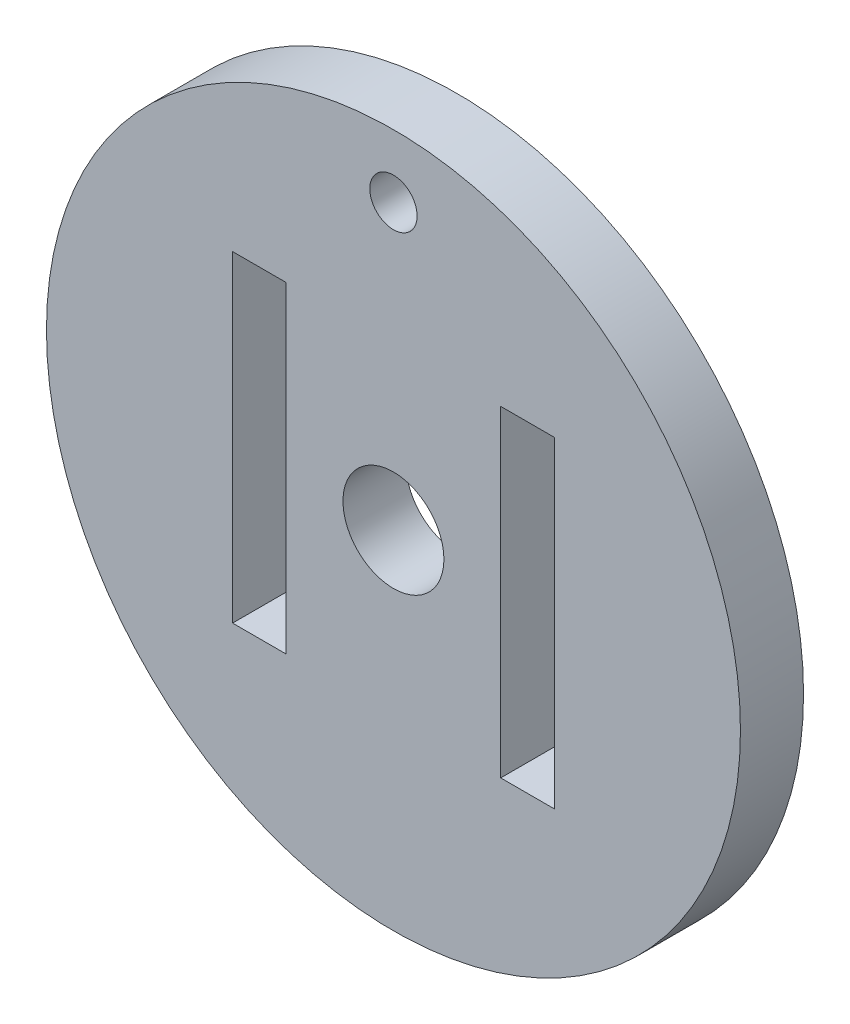
ISO-10303-21;
HEADER;
FILE_DESCRIPTION(('STEP AP214'),'2;1');
FILE_NAME('part.step','',(''),(''),'','','');
FILE_SCHEMA(('AUTOMOTIVE_DESIGN { 1 0 10303 214 1 1 1 1 }'));
ENDSEC;
DATA;
#1=APPLICATION_CONTEXT('core data for automotive mechanical design processes');
#2=APPLICATION_PROTOCOL_DEFINITION('international standard','automotive_design',2000,#1);
#3=PRODUCT_CONTEXT('',#1,'mechanical');
#4=PRODUCT('Part','Part','',(#3));
#5=PRODUCT_RELATED_PRODUCT_CATEGORY('part','',(#4));
#6=PRODUCT_DEFINITION_FORMATION('','',#4);
#7=PRODUCT_DEFINITION_CONTEXT('part definition',#1,'design');
#8=PRODUCT_DEFINITION('design','',#6,#7);
#9=PRODUCT_DEFINITION_SHAPE('','',#8);
#10=(LENGTH_UNIT() NAMED_UNIT(*) SI_UNIT(.MILLI.,.METRE.));
#11=(NAMED_UNIT(*) PLANE_ANGLE_UNIT() SI_UNIT($,.RADIAN.));
#12=(NAMED_UNIT(*) SI_UNIT($,.STERADIAN.) SOLID_ANGLE_UNIT());
#13=UNCERTAINTY_MEASURE_WITH_UNIT(LENGTH_MEASURE(1.E-05),#10,'distance_accuracy_value','');
#14=(GEOMETRIC_REPRESENTATION_CONTEXT(3) GLOBAL_UNCERTAINTY_ASSIGNED_CONTEXT((#13)) GLOBAL_UNIT_ASSIGNED_CONTEXT((#10,
#11,#12)) REPRESENTATION_CONTEXT('',''));
#15=CARTESIAN_POINT('',(0.,0.,0.));
#16=DIRECTION('',(0.,0.,1.));
#17=DIRECTION('',(1.,0.,0.));
#18=AXIS2_PLACEMENT_3D('',#15,#16,#17);
#19=CARTESIAN_POINT('',(0.,0.,2.));
#20=DIRECTION('',(0.,0.,1.));
#21=DIRECTION('',(1.,0.,0.));
#22=AXIS2_PLACEMENT_3D('',#19,#20,#21);
#23=PLANE('',#22);
#24=DIRECTION('',(1.,0.,0.));
#25=VECTOR('',#24,1.);
#26=CARTESIAN_POINT('',(-5.1,-5.1,2.));
#27=LINE('',#26,#25);
#28=CARTESIAN_POINT('',(-5.1,-5.1,2.));
#29=VERTEX_POINT('',#28);
#30=CARTESIAN_POINT('',(-3.4,-5.1,2.));
#31=VERTEX_POINT('',#30);
#32=EDGE_CURVE('E135',#29,#31,#27,.T.);
#33=ORIENTED_EDGE('',*,*,#32,.F.);
#34=DIRECTION('',(0.,-1.,0.));
#35=VECTOR('',#34,1.);
#36=CARTESIAN_POINT('',(-5.1,5.1,2.));
#37=LINE('',#36,#35);
#38=CARTESIAN_POINT('',(-5.1,5.1,2.));
#39=VERTEX_POINT('',#38);
#40=EDGE_CURVE('E133',#39,#29,#37,.T.);
#41=ORIENTED_EDGE('',*,*,#40,.F.);
#42=DIRECTION('',(-1.,0.,0.));
#43=VECTOR('',#42,1.);
#44=CARTESIAN_POINT('',(-5.1,5.1,2.));
#45=LINE('',#44,#43);
#46=CARTESIAN_POINT('',(-3.4,5.1,2.));
#47=VERTEX_POINT('',#46);
#48=EDGE_CURVE('E141',#47,#39,#45,.T.);
#49=ORIENTED_EDGE('',*,*,#48,.F.);
#50=DIRECTION('',(0.,1.,0.));
#51=VECTOR('',#50,1.);
#52=CARTESIAN_POINT('',(-3.4,5.1,2.));
#53=LINE('',#52,#51);
#54=EDGE_CURVE('E138',#31,#47,#53,.T.);
#55=ORIENTED_EDGE('',*,*,#54,.F.);
#56=EDGE_LOOP('',(#33,#41,#49,#55));
#57=FACE_BOUND('',#56,.T.);
#58=CARTESIAN_POINT('',(0.,0.,2.));
#59=DIRECTION('',(0.,0.,1.));
#60=DIRECTION('',(1.,0.,0.));
#61=AXIS2_PLACEMENT_3D('',#58,#59,#60);
#62=CIRCLE('',#61,1.6);
#63=CARTESIAN_POINT('',(1.6,0.,2.));
#64=VERTEX_POINT('',#63);
#65=EDGE_CURVE('E170',#64,#64,#62,.T.);
#66=ORIENTED_EDGE('',*,*,#65,.F.);
#67=EDGE_LOOP('',(#66));
#68=FACE_BOUND('',#67,.T.);
#69=CARTESIAN_POINT('',(0.,0.,2.));
#70=DIRECTION('',(0.,0.,1.));
#71=DIRECTION('',(1.,0.,0.));
#72=AXIS2_PLACEMENT_3D('',#69,#70,#71);
#73=CIRCLE('',#72,10.9999999999456);
#74=CARTESIAN_POINT('',(10.9999999999456,0.,2.));
#75=VERTEX_POINT('',#74);
#76=EDGE_CURVE('E11',#75,#75,#73,.T.);
#77=ORIENTED_EDGE('',*,*,#76,.T.);
#78=EDGE_LOOP('',(#77));
#79=FACE_BOUND('',#78,.T.);
#80=CARTESIAN_POINT('',(0.,9.,2.));
#81=DIRECTION('',(0.,0.,1.));
#82=DIRECTION('',(1.,0.,0.));
#83=AXIS2_PLACEMENT_3D('',#80,#81,#82);
#84=CIRCLE('',#83,0.75);
#85=CARTESIAN_POINT('',(0.75,9.,2.));
#86=VERTEX_POINT('',#85);
#87=EDGE_CURVE('E164',#86,#86,#84,.T.);
#88=ORIENTED_EDGE('',*,*,#87,.F.);
#89=EDGE_LOOP('',(#88));
#90=FACE_BOUND('',#89,.T.);
#91=DIRECTION('',(0.,-1.,0.));
#92=VECTOR('',#91,1.);
#93=CARTESIAN_POINT('',(3.4,5.1,2.));
#94=LINE('',#93,#92);
#95=CARTESIAN_POINT('',(3.4,5.1,2.));
#96=VERTEX_POINT('',#95);
#97=CARTESIAN_POINT('',(3.4,-5.1,2.));
#98=VERTEX_POINT('',#97);
#99=EDGE_CURVE('E105',#96,#98,#94,.T.);
#100=ORIENTED_EDGE('',*,*,#99,.F.);
#101=DIRECTION('',(-1.,0.,0.));
#102=VECTOR('',#101,1.);
#103=CARTESIAN_POINT('',(5.1,5.1,2.));
#104=LINE('',#103,#102);
#105=CARTESIAN_POINT('',(5.1,5.1,2.));
#106=VERTEX_POINT('',#105);
#107=EDGE_CURVE('E97',#106,#96,#104,.T.);
#108=ORIENTED_EDGE('',*,*,#107,.F.);
#109=DIRECTION('',(0.,1.,0.));
#110=VECTOR('',#109,1.);
#111=CARTESIAN_POINT('',(5.1,5.1,2.));
#112=LINE('',#111,#110);
#113=CARTESIAN_POINT('',(5.1,-5.1,2.));
#114=VERTEX_POINT('',#113);
#115=EDGE_CURVE('E119',#114,#106,#112,.T.);
#116=ORIENTED_EDGE('',*,*,#115,.F.);
#117=DIRECTION('',(1.,0.,0.));
#118=VECTOR('',#117,1.);
#119=CARTESIAN_POINT('',(5.1,-5.1,2.));
#120=LINE('',#119,#118);
#121=EDGE_CURVE('E117',#98,#114,#120,.T.);
#122=ORIENTED_EDGE('',*,*,#121,.F.);
#123=EDGE_LOOP('',(#100,#108,#116,#122));
#124=FACE_BOUND('',#123,.T.);
#125=ADVANCED_FACE('F32',(#57,#68,#79,#90,#124),#23,.T.);
#126=CARTESIAN_POINT('',(0.,0.,0.));
#127=DIRECTION('',(0.,0.,1.));
#128=DIRECTION('',(1.,0.,0.));
#129=AXIS2_PLACEMENT_3D('',#126,#127,#128);
#130=PLANE('',#129);
#131=DIRECTION('',(0.,-1.,0.));
#132=VECTOR('',#131,1.);
#133=CARTESIAN_POINT('',(-5.1,5.1,0.));
#134=LINE('',#133,#132);
#135=CARTESIAN_POINT('',(-5.1,5.1,0.));
#136=VERTEX_POINT('',#135);
#137=CARTESIAN_POINT('',(-5.1,-5.1,0.));
#138=VERTEX_POINT('',#137);
#139=EDGE_CURVE('E113',#136,#138,#134,.T.);
#140=ORIENTED_EDGE('',*,*,#139,.T.);
#141=DIRECTION('',(1.,0.,0.));
#142=VECTOR('',#141,1.);
#143=CARTESIAN_POINT('',(-5.1,-5.1,0.));
#144=LINE('',#143,#142);
#145=CARTESIAN_POINT('',(-3.4,-5.1,0.));
#146=VERTEX_POINT('',#145);
#147=EDGE_CURVE('E146',#138,#146,#144,.T.);
#148=ORIENTED_EDGE('',*,*,#147,.T.);
#149=DIRECTION('',(0.,1.,0.));
#150=VECTOR('',#149,1.);
#151=CARTESIAN_POINT('',(-3.4,5.1,0.));
#152=LINE('',#151,#150);
#153=CARTESIAN_POINT('',(-3.4,5.1,0.));
#154=VERTEX_POINT('',#153);
#155=EDGE_CURVE('E149',#146,#154,#152,.T.);
#156=ORIENTED_EDGE('',*,*,#155,.T.);
#157=DIRECTION('',(-1.,0.,0.));
#158=VECTOR('',#157,1.);
#159=CARTESIAN_POINT('',(-5.1,5.1,0.));
#160=LINE('',#159,#158);
#161=EDGE_CURVE('E136',#154,#136,#160,.T.);
#162=ORIENTED_EDGE('',*,*,#161,.T.);
#163=EDGE_LOOP('',(#140,#148,#156,#162));
#164=FACE_BOUND('',#163,.T.);
#165=CARTESIAN_POINT('',(0.,0.,0.));
#166=DIRECTION('',(0.,0.,1.));
#167=DIRECTION('',(1.,0.,0.));
#168=AXIS2_PLACEMENT_3D('',#165,#166,#167);
#169=CIRCLE('',#168,1.6);
#170=CARTESIAN_POINT('',(1.6,0.,0.));
#171=VERTEX_POINT('',#170);
#172=EDGE_CURVE('E167',#171,#171,#169,.T.);
#173=ORIENTED_EDGE('',*,*,#172,.T.);
#174=EDGE_LOOP('',(#173));
#175=FACE_BOUND('',#174,.T.);
#176=CARTESIAN_POINT('',(0.,0.,0.));
#177=DIRECTION('',(0.,0.,1.));
#178=DIRECTION('',(1.,0.,0.));
#179=AXIS2_PLACEMENT_3D('',#176,#177,#178);
#180=CIRCLE('',#179,10.9999999999456);
#181=CARTESIAN_POINT('',(10.9999999999456,0.,0.));
#182=VERTEX_POINT('',#181);
#183=EDGE_CURVE('E36',#182,#182,#180,.T.);
#184=ORIENTED_EDGE('',*,*,#183,.F.);
#185=EDGE_LOOP('',(#184));
#186=FACE_BOUND('',#185,.T.);
#187=CARTESIAN_POINT('',(0.,9.,0.));
#188=DIRECTION('',(0.,0.,1.));
#189=DIRECTION('',(1.,0.,0.));
#190=AXIS2_PLACEMENT_3D('',#187,#188,#189);
#191=CIRCLE('',#190,0.75);
#192=CARTESIAN_POINT('',(0.75,9.,0.));
#193=VERTEX_POINT('',#192);
#194=EDGE_CURVE('E163',#193,#193,#191,.T.);
#195=ORIENTED_EDGE('',*,*,#194,.T.);
#196=EDGE_LOOP('',(#195));
#197=FACE_BOUND('',#196,.T.);
#198=DIRECTION('',(-1.,0.,0.));
#199=VECTOR('',#198,1.);
#200=CARTESIAN_POINT('',(5.1,5.1,0.));
#201=LINE('',#200,#199);
#202=CARTESIAN_POINT('',(5.1,5.1,0.));
#203=VERTEX_POINT('',#202);
#204=CARTESIAN_POINT('',(3.4,5.1,0.));
#205=VERTEX_POINT('',#204);
#206=EDGE_CURVE('E55',#203,#205,#201,.T.);
#207=ORIENTED_EDGE('',*,*,#206,.T.);
#208=DIRECTION('',(0.,-1.,0.));
#209=VECTOR('',#208,1.);
#210=CARTESIAN_POINT('',(3.4,5.1,0.));
#211=LINE('',#210,#209);
#212=CARTESIAN_POINT('',(3.4,-5.1,0.));
#213=VERTEX_POINT('',#212);
#214=EDGE_CURVE('E112',#205,#213,#211,.T.);
#215=ORIENTED_EDGE('',*,*,#214,.T.);
#216=DIRECTION('',(1.,0.,0.));
#217=VECTOR('',#216,1.);
#218=CARTESIAN_POINT('',(5.1,-5.1,0.));
#219=LINE('',#218,#217);
#220=CARTESIAN_POINT('',(5.1,-5.1,0.));
#221=VERTEX_POINT('',#220);
#222=EDGE_CURVE('E125',#213,#221,#219,.T.);
#223=ORIENTED_EDGE('',*,*,#222,.T.);
#224=DIRECTION('',(0.,1.,0.));
#225=VECTOR('',#224,1.);
#226=CARTESIAN_POINT('',(5.1,5.1,0.));
#227=LINE('',#226,#225);
#228=EDGE_CURVE('E106',#221,#203,#227,.T.);
#229=ORIENTED_EDGE('',*,*,#228,.T.);
#230=EDGE_LOOP('',(#207,#215,#223,#229));
#231=FACE_BOUND('',#230,.T.);
#232=ADVANCED_FACE('F176',(#164,#175,#186,#197,#231),#130,.F.);
#233=CARTESIAN_POINT('',(0.,0.,2.));
#234=DIRECTION('',(0.,0.,-1.));
#235=DIRECTION('',(-1.,0.,0.));
#236=AXIS2_PLACEMENT_3D('',#233,#234,#235);
#237=CYLINDRICAL_SURFACE('',#236,10.9999999999456);
#238=ORIENTED_EDGE('',*,*,#76,.F.);
#239=EDGE_LOOP('',(#238));
#240=FACE_BOUND('',#239,.T.);
#241=ORIENTED_EDGE('',*,*,#183,.T.);
#242=EDGE_LOOP('',(#241));
#243=FACE_BOUND('',#242,.T.);
#244=ADVANCED_FACE('F34',(#240,#243),#237,.T.);
#245=CARTESIAN_POINT('',(0.,0.,2.));
#246=DIRECTION('',(0.,0.,-1.));
#247=DIRECTION('',(-1.,0.,0.));
#248=AXIS2_PLACEMENT_3D('',#245,#246,#247);
#249=CYLINDRICAL_SURFACE('',#248,1.6);
#250=ORIENTED_EDGE('',*,*,#65,.T.);
#251=EDGE_LOOP('',(#250));
#252=FACE_BOUND('',#251,.T.);
#253=ORIENTED_EDGE('',*,*,#172,.F.);
#254=EDGE_LOOP('',(#253));
#255=FACE_BOUND('',#254,.T.);
#256=ADVANCED_FACE('F179',(#252,#255),#249,.F.);
#257=CARTESIAN_POINT('',(0.,9.,2.));
#258=DIRECTION('',(0.,0.,-1.));
#259=DIRECTION('',(-1.,0.,0.));
#260=AXIS2_PLACEMENT_3D('',#257,#258,#259);
#261=CYLINDRICAL_SURFACE('',#260,0.75);
#262=ORIENTED_EDGE('',*,*,#87,.T.);
#263=EDGE_LOOP('',(#262));
#264=FACE_BOUND('',#263,.T.);
#265=ORIENTED_EDGE('',*,*,#194,.F.);
#266=EDGE_LOOP('',(#265));
#267=FACE_BOUND('',#266,.T.);
#268=ADVANCED_FACE('F181',(#264,#267),#261,.F.);
#269=CARTESIAN_POINT('',(-5.1,5.1,2.));
#270=DIRECTION('',(1.,0.,0.));
#271=DIRECTION('',(0.,0.,-1.));
#272=AXIS2_PLACEMENT_3D('',#269,#270,#271);
#273=PLANE('',#272);
#274=ORIENTED_EDGE('',*,*,#139,.F.);
#275=DIRECTION('',(0.,0.,-1.));
#276=VECTOR('',#275,1.);
#277=CARTESIAN_POINT('',(-5.1,5.1,2.));
#278=LINE('',#277,#276);
#279=EDGE_CURVE('E143',#39,#136,#278,.T.);
#280=ORIENTED_EDGE('',*,*,#279,.F.);
#281=ORIENTED_EDGE('',*,*,#40,.T.);
#282=DIRECTION('',(0.,0.,-1.));
#283=VECTOR('',#282,1.);
#284=CARTESIAN_POINT('',(-5.1,-5.1,2.));
#285=LINE('',#284,#283);
#286=EDGE_CURVE('E160',#29,#138,#285,.T.);
#287=ORIENTED_EDGE('',*,*,#286,.T.);
#288=EDGE_LOOP('',(#274,#280,#281,#287));
#289=FACE_BOUND('',#288,.T.);
#290=ADVANCED_FACE('F188',(#289),#273,.T.);
#291=CARTESIAN_POINT('',(-5.1,-5.1,2.));
#292=DIRECTION('',(0.,1.,0.));
#293=DIRECTION('',(0.,0.,1.));
#294=AXIS2_PLACEMENT_3D('',#291,#292,#293);
#295=PLANE('',#294);
#296=ORIENTED_EDGE('',*,*,#147,.F.);
#297=ORIENTED_EDGE('',*,*,#286,.F.);
#298=ORIENTED_EDGE('',*,*,#32,.T.);
#299=DIRECTION('',(0.,0.,-1.));
#300=VECTOR('',#299,1.);
#301=CARTESIAN_POINT('',(-3.4,-5.1,2.));
#302=LINE('',#301,#300);
#303=EDGE_CURVE('E158',#31,#146,#302,.T.);
#304=ORIENTED_EDGE('',*,*,#303,.T.);
#305=EDGE_LOOP('',(#296,#297,#298,#304));
#306=FACE_BOUND('',#305,.T.);
#307=ADVANCED_FACE('F234',(#306),#295,.T.);
#308=CARTESIAN_POINT('',(-3.4,5.1,2.));
#309=DIRECTION('',(-1.,0.,0.));
#310=DIRECTION('',(0.,0.,1.));
#311=AXIS2_PLACEMENT_3D('',#308,#309,#310);
#312=PLANE('',#311);
#313=ORIENTED_EDGE('',*,*,#155,.F.);
#314=ORIENTED_EDGE('',*,*,#303,.F.);
#315=ORIENTED_EDGE('',*,*,#54,.T.);
#316=DIRECTION('',(0.,0.,-1.));
#317=VECTOR('',#316,1.);
#318=CARTESIAN_POINT('',(-3.4,5.1,2.));
#319=LINE('',#318,#317);
#320=EDGE_CURVE('E156',#47,#154,#319,.T.);
#321=ORIENTED_EDGE('',*,*,#320,.T.);
#322=EDGE_LOOP('',(#313,#314,#315,#321));
#323=FACE_BOUND('',#322,.T.);
#324=ADVANCED_FACE('F230',(#323),#312,.T.);
#325=CARTESIAN_POINT('',(-5.1,5.1,2.));
#326=DIRECTION('',(0.,-1.,0.));
#327=DIRECTION('',(0.,0.,-1.));
#328=AXIS2_PLACEMENT_3D('',#325,#326,#327);
#329=PLANE('',#328);
#330=ORIENTED_EDGE('',*,*,#161,.F.);
#331=ORIENTED_EDGE('',*,*,#320,.F.);
#332=ORIENTED_EDGE('',*,*,#48,.T.);
#333=ORIENTED_EDGE('',*,*,#279,.T.);
#334=EDGE_LOOP('',(#330,#331,#332,#333));
#335=FACE_BOUND('',#334,.T.);
#336=ADVANCED_FACE('F227',(#335),#329,.T.);
#337=CARTESIAN_POINT('',(5.1,5.1,2.));
#338=DIRECTION('',(0.,-1.,0.));
#339=DIRECTION('',(0.,0.,-1.));
#340=AXIS2_PLACEMENT_3D('',#337,#338,#339);
#341=PLANE('',#340);
#342=ORIENTED_EDGE('',*,*,#206,.F.);
#343=DIRECTION('',(0.,0.,-1.));
#344=VECTOR('',#343,1.);
#345=CARTESIAN_POINT('',(5.1,5.1,2.));
#346=LINE('',#345,#344);
#347=EDGE_CURVE('E101',#106,#203,#346,.T.);
#348=ORIENTED_EDGE('',*,*,#347,.F.);
#349=ORIENTED_EDGE('',*,*,#107,.T.);
#350=DIRECTION('',(0.,0.,-1.));
#351=VECTOR('',#350,1.);
#352=CARTESIAN_POINT('',(3.4,5.1,2.));
#353=LINE('',#352,#351);
#354=EDGE_CURVE('E100',#96,#205,#353,.T.);
#355=ORIENTED_EDGE('',*,*,#354,.T.);
#356=EDGE_LOOP('',(#342,#348,#349,#355));
#357=FACE_BOUND('',#356,.T.);
#358=ADVANCED_FACE('F99',(#357),#341,.T.);
#359=CARTESIAN_POINT('',(3.4,5.1,2.));
#360=DIRECTION('',(1.,0.,0.));
#361=DIRECTION('',(0.,0.,-1.));
#362=AXIS2_PLACEMENT_3D('',#359,#360,#361);
#363=PLANE('',#362);
#364=ORIENTED_EDGE('',*,*,#214,.F.);
#365=ORIENTED_EDGE('',*,*,#354,.F.);
#366=ORIENTED_EDGE('',*,*,#99,.T.);
#367=DIRECTION('',(0.,0.,-1.));
#368=VECTOR('',#367,1.);
#369=CARTESIAN_POINT('',(3.4,-5.1,2.));
#370=LINE('',#369,#368);
#371=EDGE_CURVE('E114',#98,#213,#370,.T.);
#372=ORIENTED_EDGE('',*,*,#371,.T.);
#373=EDGE_LOOP('',(#364,#365,#366,#372));
#374=FACE_BOUND('',#373,.T.);
#375=ADVANCED_FACE('F109',(#374),#363,.T.);
#376=CARTESIAN_POINT('',(5.1,-5.1,2.));
#377=DIRECTION('',(0.,1.,0.));
#378=DIRECTION('',(0.,0.,1.));
#379=AXIS2_PLACEMENT_3D('',#376,#377,#378);
#380=PLANE('',#379);
#381=ORIENTED_EDGE('',*,*,#222,.F.);
#382=ORIENTED_EDGE('',*,*,#371,.F.);
#383=ORIENTED_EDGE('',*,*,#121,.T.);
#384=DIRECTION('',(0.,0.,-1.));
#385=VECTOR('',#384,1.);
#386=CARTESIAN_POINT('',(5.1,-5.1,2.));
#387=LINE('',#386,#385);
#388=EDGE_CURVE('E47',#114,#221,#387,.T.);
#389=ORIENTED_EDGE('',*,*,#388,.T.);
#390=EDGE_LOOP('',(#381,#382,#383,#389));
#391=FACE_BOUND('',#390,.T.);
#392=ADVANCED_FACE('F215',(#391),#380,.T.);
#393=CARTESIAN_POINT('',(5.1,5.1,2.));
#394=DIRECTION('',(-1.,0.,0.));
#395=DIRECTION('',(0.,0.,1.));
#396=AXIS2_PLACEMENT_3D('',#393,#394,#395);
#397=PLANE('',#396);
#398=ORIENTED_EDGE('',*,*,#228,.F.);
#399=ORIENTED_EDGE('',*,*,#388,.F.);
#400=ORIENTED_EDGE('',*,*,#115,.T.);
#401=ORIENTED_EDGE('',*,*,#347,.T.);
#402=EDGE_LOOP('',(#398,#399,#400,#401));
#403=FACE_BOUND('',#402,.T.);
#404=ADVANCED_FACE('F213',(#403),#397,.T.);
#405=CLOSED_SHELL('',(#125,#232,#244,#256,#268,#290,#307,#324,#336,#358,#375,#392,#404));
#406=MANIFOLD_SOLID_BREP('B2',#405);
#407=ADVANCED_BREP_SHAPE_REPRESENTATION('',(#18,#406),#14);
#408=SHAPE_DEFINITION_REPRESENTATION(#9,#407);
ENDSEC;
END-ISO-10303-21;
